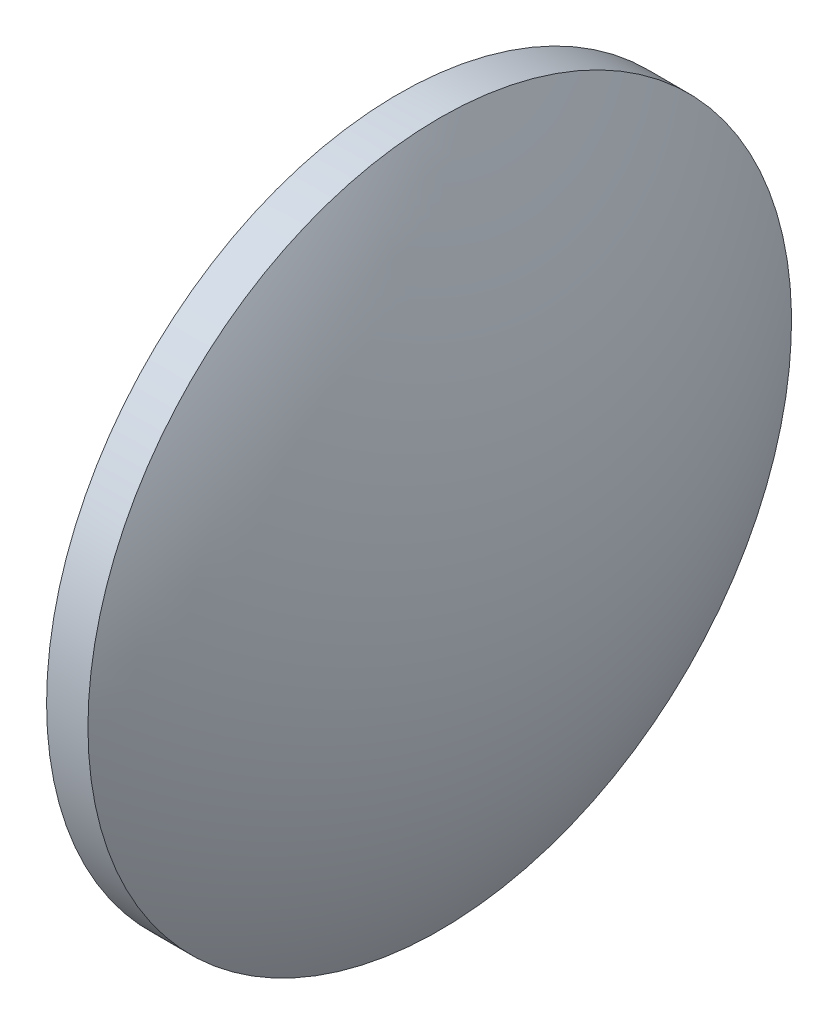
ISO-10303-21;
HEADER;
FILE_DESCRIPTION(('STEP AP214'),'2;1');
FILE_NAME('part.step','',(''),(''),'','','');
FILE_SCHEMA(('AUTOMOTIVE_DESIGN { 1 0 10303 214 1 1 1 1 }'));
ENDSEC;
DATA;
#1=APPLICATION_CONTEXT('core data for automotive mechanical design processes');
#2=APPLICATION_PROTOCOL_DEFINITION('international standard','automotive_design',2000,#1);
#3=PRODUCT_CONTEXT('',#1,'mechanical');
#4=PRODUCT('Part','Part','',(#3));
#5=PRODUCT_RELATED_PRODUCT_CATEGORY('part','',(#4));
#6=PRODUCT_DEFINITION_FORMATION('','',#4);
#7=PRODUCT_DEFINITION_CONTEXT('part definition',#1,'design');
#8=PRODUCT_DEFINITION('design','',#6,#7);
#9=PRODUCT_DEFINITION_SHAPE('','',#8);
#10=(LENGTH_UNIT() NAMED_UNIT(*) SI_UNIT(.MILLI.,.METRE.));
#11=(NAMED_UNIT(*) PLANE_ANGLE_UNIT() SI_UNIT($,.RADIAN.));
#12=(NAMED_UNIT(*) SI_UNIT($,.STERADIAN.) SOLID_ANGLE_UNIT());
#13=UNCERTAINTY_MEASURE_WITH_UNIT(LENGTH_MEASURE(1.E-05),#10,'distance_accuracy_value','');
#14=(GEOMETRIC_REPRESENTATION_CONTEXT(3) GLOBAL_UNCERTAINTY_ASSIGNED_CONTEXT((#13)) GLOBAL_UNIT_ASSIGNED_CONTEXT((#10,
#11,#12)) REPRESENTATION_CONTEXT('',''));
#15=CARTESIAN_POINT('',(0.,0.,0.));
#16=DIRECTION('',(0.,0.,1.));
#17=DIRECTION('',(1.,0.,0.));
#18=AXIS2_PLACEMENT_3D('',#15,#16,#17);
#19=CARTESIAN_POINT('',(512.879848872937,140.681065343663,0.));
#20=DIRECTION('',(-1.,0.,0.));
#21=DIRECTION('',(0.,1.,0.));
#22=AXIS2_PLACEMENT_3D('',#19,#20,#21);
#23=SPHERICAL_SURFACE('',#22,25.8023065015481);
#24=CARTESIAN_POINT('',(535.452155374486,140.681065343663,0.));
#25=DIRECTION('',(-1.,0.,0.));
#26=DIRECTION('',(0.,0.,1.));
#27=AXIS2_PLACEMENT_3D('',#24,#25,#26);
#28=CIRCLE('',#27,12.5);
#29=CARTESIAN_POINT('',(535.452155374486,140.681065343663,12.5));
#30=VERTEX_POINT('',#29);
#31=EDGE_CURVE('E10',#30,#30,#28,.T.);
#32=ORIENTED_EDGE('',*,*,#31,.F.);
#33=EDGE_LOOP('',(#32));
#34=FACE_BOUND('',#33,.T.);
#35=ADVANCED_FACE('F33',(#34),#23,.T.);
#36=CARTESIAN_POINT('',(529.240124132596,140.681065343663,0.));
#37=DIRECTION('',(-1.,0.,0.));
#38=DIRECTION('',(0.,0.,1.));
#39=AXIS2_PLACEMENT_3D('',#36,#37,#38);
#40=CYLINDRICAL_SURFACE('',#39,12.5);
#41=CARTESIAN_POINT('',(533.982155374486,140.681065343663,0.));
#42=DIRECTION('',(-1.,0.,0.));
#43=DIRECTION('',(0.,0.,1.));
#44=AXIS2_PLACEMENT_3D('',#41,#42,#43);
#45=CIRCLE('',#44,12.5);
#46=CARTESIAN_POINT('',(533.982155374486,140.681065343663,12.5));
#47=VERTEX_POINT('',#46);
#48=EDGE_CURVE('E39',#47,#47,#45,.T.);
#49=ORIENTED_EDGE('',*,*,#48,.F.);
#50=EDGE_LOOP('',(#49));
#51=FACE_BOUND('',#50,.T.);
#52=ORIENTED_EDGE('',*,*,#31,.T.);
#53=EDGE_LOOP('',(#52));
#54=FACE_BOUND('',#53,.T.);
#55=ADVANCED_FACE('F47',(#51,#54),#40,.T.);
#56=CARTESIAN_POINT('',(533.982155374486,140.681065343663,0.));
#57=DIRECTION('',(1.,0.,0.));
#58=DIRECTION('',(0.,0.,-1.));
#59=AXIS2_PLACEMENT_3D('',#56,#57,#58);
#60=PLANE('',#59);
#61=ORIENTED_EDGE('',*,*,#48,.T.);
#62=EDGE_LOOP('',(#61));
#63=FACE_BOUND('',#62,.T.);
#64=ADVANCED_FACE('F45',(#63),#60,.F.);
#65=CLOSED_SHELL('',(#35,#55,#64));
#66=MANIFOLD_SOLID_BREP('B2',#65);
#67=ADVANCED_BREP_SHAPE_REPRESENTATION('',(#18,#66),#14);
#68=SHAPE_DEFINITION_REPRESENTATION(#9,#67);
ENDSEC;
END-ISO-10303-21;
